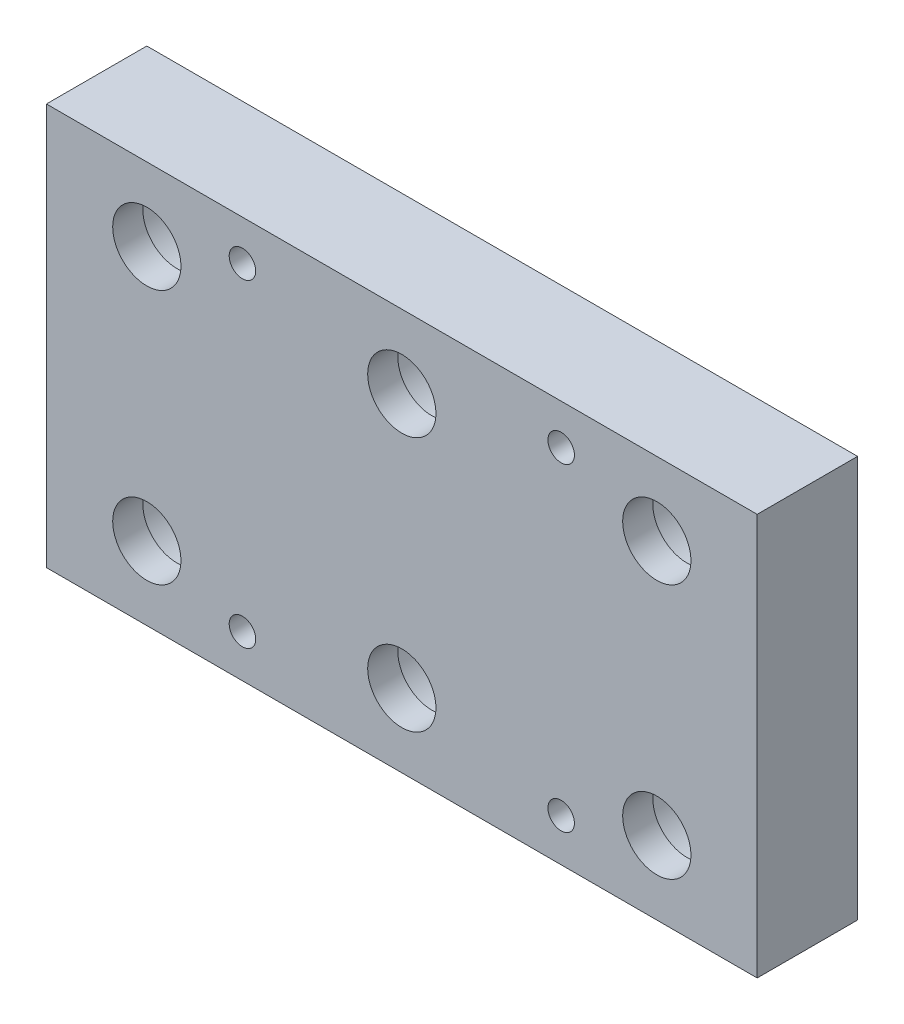
ISO-10303-21;
HEADER;
FILE_DESCRIPTION(('STEP AP214'),'2;1');
FILE_NAME('part.step','',(''),(''),'','','');
FILE_SCHEMA(('AUTOMOTIVE_DESIGN { 1 0 10303 214 1 1 1 1 }'));
ENDSEC;
DATA;
#1=APPLICATION_CONTEXT('core data for automotive mechanical design processes');
#2=APPLICATION_PROTOCOL_DEFINITION('international standard','automotive_design',2000,#1);
#3=PRODUCT_CONTEXT('',#1,'mechanical');
#4=PRODUCT('Part','Part','',(#3));
#5=PRODUCT_RELATED_PRODUCT_CATEGORY('part','',(#4));
#6=PRODUCT_DEFINITION_FORMATION('','',#4);
#7=PRODUCT_DEFINITION_CONTEXT('part definition',#1,'design');
#8=PRODUCT_DEFINITION('design','',#6,#7);
#9=PRODUCT_DEFINITION_SHAPE('','',#8);
#10=(LENGTH_UNIT() NAMED_UNIT(*) SI_UNIT(.MILLI.,.METRE.));
#11=(NAMED_UNIT(*) PLANE_ANGLE_UNIT() SI_UNIT($,.RADIAN.));
#12=(NAMED_UNIT(*) SI_UNIT($,.STERADIAN.) SOLID_ANGLE_UNIT());
#13=UNCERTAINTY_MEASURE_WITH_UNIT(LENGTH_MEASURE(1.E-05),#10,'distance_accuracy_value','');
#14=(GEOMETRIC_REPRESENTATION_CONTEXT(3) GLOBAL_UNCERTAINTY_ASSIGNED_CONTEXT((#13)) GLOBAL_UNIT_ASSIGNED_CONTEXT((#10,
#11,#12)) REPRESENTATION_CONTEXT('',''));
#15=CARTESIAN_POINT('',(0.,0.,0.));
#16=DIRECTION('',(0.,0.,1.));
#17=DIRECTION('',(1.,0.,0.));
#18=AXIS2_PLACEMENT_3D('',#15,#16,#17);
#19=CARTESIAN_POINT('',(-25.4,12.7,10.));
#20=DIRECTION('',(0.,0.,-1.));
#21=DIRECTION('',(-1.,0.,0.));
#22=AXIS2_PLACEMENT_3D('',#19,#20,#21);
#23=CYLINDRICAL_SURFACE('',#22,3.4);
#24=CARTESIAN_POINT('',(-25.4,12.7,10.));
#25=DIRECTION('',(0.,0.,-1.));
#26=DIRECTION('',(-1.,0.,0.));
#27=AXIS2_PLACEMENT_3D('',#24,#25,#26);
#28=CIRCLE('',#27,3.4);
#29=CARTESIAN_POINT('',(-28.8,12.7,10.));
#30=VERTEX_POINT('',#29);
#31=EDGE_CURVE('E164',#30,#30,#28,.T.);
#32=ORIENTED_EDGE('',*,*,#31,.F.);
#33=EDGE_LOOP('',(#32));
#34=FACE_BOUND('',#33,.T.);
#35=CARTESIAN_POINT('',(-25.4,12.7,7.));
#36=DIRECTION('',(0.,0.,-1.));
#37=DIRECTION('',(-1.,0.,0.));
#38=AXIS2_PLACEMENT_3D('',#35,#36,#37);
#39=CIRCLE('',#38,3.4);
#40=CARTESIAN_POINT('',(-28.8,12.7,7.));
#41=VERTEX_POINT('',#40);
#42=EDGE_CURVE('E38',#41,#41,#39,.F.);
#43=ORIENTED_EDGE('',*,*,#42,.F.);
#44=EDGE_LOOP('',(#43));
#45=FACE_BOUND('',#44,.T.);
#46=ADVANCED_FACE('F34',(#34,#45),#23,.F.);
#47=CARTESIAN_POINT('',(25.4,12.7,10.));
#48=DIRECTION('',(0.,0.,-1.));
#49=DIRECTION('',(-1.,0.,0.));
#50=AXIS2_PLACEMENT_3D('',#47,#48,#49);
#51=CYLINDRICAL_SURFACE('',#50,3.4);
#52=CARTESIAN_POINT('',(25.4,12.7,10.));
#53=DIRECTION('',(0.,0.,-1.));
#54=DIRECTION('',(-1.,0.,0.));
#55=AXIS2_PLACEMENT_3D('',#52,#53,#54);
#56=CIRCLE('',#55,3.4);
#57=CARTESIAN_POINT('',(22.,12.7,10.));
#58=VERTEX_POINT('',#57);
#59=EDGE_CURVE('E113',#58,#58,#56,.T.);
#60=ORIENTED_EDGE('',*,*,#59,.F.);
#61=EDGE_LOOP('',(#60));
#62=FACE_BOUND('',#61,.T.);
#63=CARTESIAN_POINT('',(25.4,12.7,7.));
#64=DIRECTION('',(0.,0.,-1.));
#65=DIRECTION('',(-1.,0.,0.));
#66=AXIS2_PLACEMENT_3D('',#63,#64,#65);
#67=CIRCLE('',#66,3.4);
#68=CARTESIAN_POINT('',(22.,12.7,7.));
#69=VERTEX_POINT('',#68);
#70=EDGE_CURVE('E129',#69,#69,#67,.F.);
#71=ORIENTED_EDGE('',*,*,#70,.F.);
#72=EDGE_LOOP('',(#71));
#73=FACE_BOUND('',#72,.T.);
#74=ADVANCED_FACE('F220',(#62,#73),#51,.F.);
#75=CARTESIAN_POINT('',(0.,12.7,10.));
#76=DIRECTION('',(0.,0.,-1.));
#77=DIRECTION('',(-1.,0.,0.));
#78=AXIS2_PLACEMENT_3D('',#75,#76,#77);
#79=CYLINDRICAL_SURFACE('',#78,3.4);
#80=CARTESIAN_POINT('',(0.,12.7,10.));
#81=DIRECTION('',(0.,0.,-1.));
#82=DIRECTION('',(-1.,0.,0.));
#83=AXIS2_PLACEMENT_3D('',#80,#81,#82);
#84=CIRCLE('',#83,3.4);
#85=CARTESIAN_POINT('',(-3.4,12.7,10.));
#86=VERTEX_POINT('',#85);
#87=EDGE_CURVE('E167',#86,#86,#84,.T.);
#88=ORIENTED_EDGE('',*,*,#87,.F.);
#89=EDGE_LOOP('',(#88));
#90=FACE_BOUND('',#89,.T.);
#91=CARTESIAN_POINT('',(0.,12.7,7.));
#92=DIRECTION('',(0.,0.,-1.));
#93=DIRECTION('',(-1.,0.,0.));
#94=AXIS2_PLACEMENT_3D('',#91,#92,#93);
#95=CIRCLE('',#94,3.4);
#96=CARTESIAN_POINT('',(-3.4,12.7,7.));
#97=VERTEX_POINT('',#96);
#98=EDGE_CURVE('E125',#97,#97,#95,.F.);
#99=ORIENTED_EDGE('',*,*,#98,.F.);
#100=EDGE_LOOP('',(#99));
#101=FACE_BOUND('',#100,.T.);
#102=ADVANCED_FACE('F226',(#90,#101),#79,.F.);
#103=CARTESIAN_POINT('',(25.4,-12.7,10.));
#104=DIRECTION('',(0.,0.,-1.));
#105=DIRECTION('',(-1.,0.,0.));
#106=AXIS2_PLACEMENT_3D('',#103,#104,#105);
#107=CYLINDRICAL_SURFACE('',#106,3.4);
#108=CARTESIAN_POINT('',(25.4,-12.7,10.));
#109=DIRECTION('',(0.,0.,-1.));
#110=DIRECTION('',(-1.,0.,0.));
#111=AXIS2_PLACEMENT_3D('',#108,#109,#110);
#112=CIRCLE('',#111,3.4);
#113=CARTESIAN_POINT('',(22.,-12.7,10.));
#114=VERTEX_POINT('',#113);
#115=EDGE_CURVE('E176',#114,#114,#112,.T.);
#116=ORIENTED_EDGE('',*,*,#115,.F.);
#117=EDGE_LOOP('',(#116));
#118=FACE_BOUND('',#117,.T.);
#119=CARTESIAN_POINT('',(25.4,-12.7,7.));
#120=DIRECTION('',(0.,0.,-1.));
#121=DIRECTION('',(-1.,0.,0.));
#122=AXIS2_PLACEMENT_3D('',#119,#120,#121);
#123=CIRCLE('',#122,3.4);
#124=CARTESIAN_POINT('',(22.,-12.7,7.));
#125=VERTEX_POINT('',#124);
#126=EDGE_CURVE('E120',#125,#125,#123,.F.);
#127=ORIENTED_EDGE('',*,*,#126,.F.);
#128=EDGE_LOOP('',(#127));
#129=FACE_BOUND('',#128,.T.);
#130=ADVANCED_FACE('F235',(#118,#129),#107,.F.);
#131=CARTESIAN_POINT('',(0.,-12.7,10.));
#132=DIRECTION('',(0.,0.,-1.));
#133=DIRECTION('',(-1.,0.,0.));
#134=AXIS2_PLACEMENT_3D('',#131,#132,#133);
#135=CYLINDRICAL_SURFACE('',#134,3.4);
#136=CARTESIAN_POINT('',(0.,-12.7,10.));
#137=DIRECTION('',(0.,0.,-1.));
#138=DIRECTION('',(-1.,0.,0.));
#139=AXIS2_PLACEMENT_3D('',#136,#137,#138);
#140=CIRCLE('',#139,3.4);
#141=CARTESIAN_POINT('',(-3.40000000000001,-12.7,10.));
#142=VERTEX_POINT('',#141);
#143=EDGE_CURVE('E173',#142,#142,#140,.T.);
#144=ORIENTED_EDGE('',*,*,#143,.F.);
#145=EDGE_LOOP('',(#144));
#146=FACE_BOUND('',#145,.T.);
#147=CARTESIAN_POINT('',(0.,-12.7,7.));
#148=DIRECTION('',(0.,0.,-1.));
#149=DIRECTION('',(-1.,0.,0.));
#150=AXIS2_PLACEMENT_3D('',#147,#148,#149);
#151=CIRCLE('',#150,3.4);
#152=CARTESIAN_POINT('',(-3.40000000000001,-12.7,7.));
#153=VERTEX_POINT('',#152);
#154=EDGE_CURVE('E115',#153,#153,#151,.F.);
#155=ORIENTED_EDGE('',*,*,#154,.F.);
#156=EDGE_LOOP('',(#155));
#157=FACE_BOUND('',#156,.T.);
#158=ADVANCED_FACE('F240',(#146,#157),#135,.F.);
#159=CARTESIAN_POINT('',(-25.4,-12.7,10.));
#160=DIRECTION('',(0.,0.,-1.));
#161=DIRECTION('',(-1.,0.,0.));
#162=AXIS2_PLACEMENT_3D('',#159,#160,#161);
#163=CYLINDRICAL_SURFACE('',#162,3.4);
#164=CARTESIAN_POINT('',(-25.4,-12.7,10.));
#165=DIRECTION('',(0.,0.,-1.));
#166=DIRECTION('',(-1.,0.,0.));
#167=AXIS2_PLACEMENT_3D('',#164,#165,#166);
#168=CIRCLE('',#167,3.4);
#169=CARTESIAN_POINT('',(-28.8,-12.7,10.));
#170=VERTEX_POINT('',#169);
#171=EDGE_CURVE('E170',#170,#170,#168,.T.);
#172=ORIENTED_EDGE('',*,*,#171,.F.);
#173=EDGE_LOOP('',(#172));
#174=FACE_BOUND('',#173,.T.);
#175=CARTESIAN_POINT('',(-25.4,-12.7,7.));
#176=DIRECTION('',(0.,0.,-1.));
#177=DIRECTION('',(-1.,0.,0.));
#178=AXIS2_PLACEMENT_3D('',#175,#176,#177);
#179=CIRCLE('',#178,3.4);
#180=CARTESIAN_POINT('',(-28.8,-12.7,7.));
#181=VERTEX_POINT('',#180);
#182=EDGE_CURVE('E110',#181,#181,#179,.F.);
#183=ORIENTED_EDGE('',*,*,#182,.F.);
#184=EDGE_LOOP('',(#183));
#185=FACE_BOUND('',#184,.T.);
#186=ADVANCED_FACE('F237',(#174,#185),#163,.F.);
#187=CARTESIAN_POINT('',(35.4,20.,10.));
#188=DIRECTION('',(-1.,0.,0.));
#189=DIRECTION('',(0.,-1.,0.));
#190=AXIS2_PLACEMENT_3D('',#187,#188,#189);
#191=PLANE('',#190);
#192=DIRECTION('',(0.,1.,0.));
#193=VECTOR('',#192,1.);
#194=CARTESIAN_POINT('',(35.4,20.,0.));
#195=LINE('',#194,#193);
#196=CARTESIAN_POINT('',(35.4,-20.,0.));
#197=VERTEX_POINT('',#196);
#198=CARTESIAN_POINT('',(35.4,20.,0.));
#199=VERTEX_POINT('',#198);
#200=EDGE_CURVE('E101',#197,#199,#195,.T.);
#201=ORIENTED_EDGE('',*,*,#200,.T.);
#202=DIRECTION('',(0.,0.,-1.));
#203=VECTOR('',#202,1.);
#204=CARTESIAN_POINT('',(35.4,20.,10.));
#205=LINE('',#204,#203);
#206=CARTESIAN_POINT('',(35.4,20.,10.));
#207=VERTEX_POINT('',#206);
#208=EDGE_CURVE('E11',#207,#199,#205,.T.);
#209=ORIENTED_EDGE('',*,*,#208,.F.);
#210=DIRECTION('',(0.,1.,0.));
#211=VECTOR('',#210,1.);
#212=CARTESIAN_POINT('',(35.4,20.,10.));
#213=LINE('',#212,#211);
#214=CARTESIAN_POINT('',(35.4,-20.,10.));
#215=VERTEX_POINT('',#214);
#216=EDGE_CURVE('E88',#215,#207,#213,.T.);
#217=ORIENTED_EDGE('',*,*,#216,.F.);
#218=DIRECTION('',(0.,0.,-1.));
#219=VECTOR('',#218,1.);
#220=CARTESIAN_POINT('',(35.4,-20.,10.));
#221=LINE('',#220,#219);
#222=EDGE_CURVE('E97',#215,#197,#221,.T.);
#223=ORIENTED_EDGE('',*,*,#222,.T.);
#224=EDGE_LOOP('',(#201,#209,#217,#223));
#225=FACE_BOUND('',#224,.T.);
#226=ADVANCED_FACE('F36',(#225),#191,.F.);
#227=CARTESIAN_POINT('',(35.4,20.,10.));
#228=DIRECTION('',(0.,-1.,0.));
#229=DIRECTION('',(1.,0.,0.));
#230=AXIS2_PLACEMENT_3D('',#227,#228,#229);
#231=PLANE('',#230);
#232=DIRECTION('',(-1.,0.,0.));
#233=VECTOR('',#232,1.);
#234=CARTESIAN_POINT('',(35.4,20.,0.));
#235=LINE('',#234,#233);
#236=CARTESIAN_POINT('',(-35.4,20.,0.));
#237=VERTEX_POINT('',#236);
#238=EDGE_CURVE('E92',#199,#237,#235,.T.);
#239=ORIENTED_EDGE('',*,*,#238,.T.);
#240=DIRECTION('',(0.,0.,-1.));
#241=VECTOR('',#240,1.);
#242=CARTESIAN_POINT('',(-35.4,20.,10.));
#243=LINE('',#242,#241);
#244=CARTESIAN_POINT('',(-35.4,20.,10.));
#245=VERTEX_POINT('',#244);
#246=EDGE_CURVE('E44',#245,#237,#243,.T.);
#247=ORIENTED_EDGE('',*,*,#246,.F.);
#248=DIRECTION('',(-1.,0.,0.));
#249=VECTOR('',#248,1.);
#250=CARTESIAN_POINT('',(35.4,20.,10.));
#251=LINE('',#250,#249);
#252=EDGE_CURVE('E83',#207,#245,#251,.T.);
#253=ORIENTED_EDGE('',*,*,#252,.F.);
#254=ORIENTED_EDGE('',*,*,#208,.T.);
#255=EDGE_LOOP('',(#239,#247,#253,#254));
#256=FACE_BOUND('',#255,.T.);
#257=ADVANCED_FACE('F91',(#256),#231,.F.);
#258=CARTESIAN_POINT('',(-35.4,20.,10.));
#259=DIRECTION('',(1.,0.,0.));
#260=DIRECTION('',(0.,1.,0.));
#261=AXIS2_PLACEMENT_3D('',#258,#259,#260);
#262=PLANE('',#261);
#263=DIRECTION('',(0.,-1.,0.));
#264=VECTOR('',#263,1.);
#265=CARTESIAN_POINT('',(-35.4,20.,0.));
#266=LINE('',#265,#264);
#267=CARTESIAN_POINT('',(-35.4,-20.,0.));
#268=VERTEX_POINT('',#267);
#269=EDGE_CURVE('E70',#237,#268,#266,.T.);
#270=ORIENTED_EDGE('',*,*,#269,.T.);
#271=DIRECTION('',(0.,0.,-1.));
#272=VECTOR('',#271,1.);
#273=CARTESIAN_POINT('',(-35.4,-20.,10.));
#274=LINE('',#273,#272);
#275=CARTESIAN_POINT('',(-35.4,-20.,10.));
#276=VERTEX_POINT('',#275);
#277=EDGE_CURVE('E93',#276,#268,#274,.T.);
#278=ORIENTED_EDGE('',*,*,#277,.F.);
#279=DIRECTION('',(0.,-1.,0.));
#280=VECTOR('',#279,1.);
#281=CARTESIAN_POINT('',(-35.4,20.,10.));
#282=LINE('',#281,#280);
#283=EDGE_CURVE('E86',#245,#276,#282,.T.);
#284=ORIENTED_EDGE('',*,*,#283,.F.);
#285=ORIENTED_EDGE('',*,*,#246,.T.);
#286=EDGE_LOOP('',(#270,#278,#284,#285));
#287=FACE_BOUND('',#286,.T.);
#288=ADVANCED_FACE('F95',(#287),#262,.F.);
#289=CARTESIAN_POINT('',(35.4,-20.,10.));
#290=DIRECTION('',(0.,1.,0.));
#291=DIRECTION('',(-1.,0.,0.));
#292=AXIS2_PLACEMENT_3D('',#289,#290,#291);
#293=PLANE('',#292);
#294=DIRECTION('',(1.,0.,0.));
#295=VECTOR('',#294,1.);
#296=CARTESIAN_POINT('',(35.4,-20.,0.));
#297=LINE('',#296,#295);
#298=EDGE_CURVE('E76',#268,#197,#297,.T.);
#299=ORIENTED_EDGE('',*,*,#298,.T.);
#300=ORIENTED_EDGE('',*,*,#222,.F.);
#301=DIRECTION('',(1.,0.,0.));
#302=VECTOR('',#301,1.);
#303=CARTESIAN_POINT('',(35.4,-20.,10.));
#304=LINE('',#303,#302);
#305=EDGE_CURVE('E53',#276,#215,#304,.T.);
#306=ORIENTED_EDGE('',*,*,#305,.F.);
#307=ORIENTED_EDGE('',*,*,#277,.T.);
#308=EDGE_LOOP('',(#299,#300,#306,#307));
#309=FACE_BOUND('',#308,.T.);
#310=ADVANCED_FACE('F207',(#309),#293,.F.);
#311=CARTESIAN_POINT('',(0.,0.,10.));
#312=DIRECTION('',(0.,0.,-1.));
#313=DIRECTION('',(-1.,0.,0.));
#314=AXIS2_PLACEMENT_3D('',#311,#312,#313);
#315=PLANE('',#314);
#316=ORIENTED_EDGE('',*,*,#59,.T.);
#317=EDGE_LOOP('',(#316));
#318=FACE_BOUND('',#317,.T.);
#319=ORIENTED_EDGE('',*,*,#31,.T.);
#320=EDGE_LOOP('',(#319));
#321=FACE_BOUND('',#320,.T.);
#322=ORIENTED_EDGE('',*,*,#87,.T.);
#323=EDGE_LOOP('',(#322));
#324=FACE_BOUND('',#323,.T.);
#325=ORIENTED_EDGE('',*,*,#171,.T.);
#326=EDGE_LOOP('',(#325));
#327=FACE_BOUND('',#326,.T.);
#328=ORIENTED_EDGE('',*,*,#143,.T.);
#329=EDGE_LOOP('',(#328));
#330=FACE_BOUND('',#329,.T.);
#331=ORIENTED_EDGE('',*,*,#115,.T.);
#332=EDGE_LOOP('',(#331));
#333=FACE_BOUND('',#332,.T.);
#334=CARTESIAN_POINT('',(15.875,16.,10.));
#335=DIRECTION('',(0.,0.,1.));
#336=DIRECTION('',(1.,0.,0.));
#337=AXIS2_PLACEMENT_3D('',#334,#335,#336);
#338=CIRCLE('',#337,1.32);
#339=CARTESIAN_POINT('',(17.195,16.,10.));
#340=VERTEX_POINT('',#339);
#341=EDGE_CURVE('E179',#340,#340,#338,.T.);
#342=ORIENTED_EDGE('',*,*,#341,.F.);
#343=EDGE_LOOP('',(#342));
#344=FACE_BOUND('',#343,.T.);
#345=CARTESIAN_POINT('',(-15.875,16.,10.));
#346=DIRECTION('',(0.,0.,1.));
#347=DIRECTION('',(1.,0.,0.));
#348=AXIS2_PLACEMENT_3D('',#345,#346,#347);
#349=CIRCLE('',#348,1.32);
#350=CARTESIAN_POINT('',(-14.555,16.,10.));
#351=VERTEX_POINT('',#350);
#352=EDGE_CURVE('E183',#351,#351,#349,.T.);
#353=ORIENTED_EDGE('',*,*,#352,.F.);
#354=EDGE_LOOP('',(#353));
#355=FACE_BOUND('',#354,.T.);
#356=CARTESIAN_POINT('',(-15.875,-15.7499999999998,10.));
#357=DIRECTION('',(0.,0.,1.));
#358=DIRECTION('',(1.,0.,0.));
#359=AXIS2_PLACEMENT_3D('',#356,#357,#358);
#360=CIRCLE('',#359,1.31999999999994);
#361=CARTESIAN_POINT('',(-14.5550000000001,-15.7499999999998,10.));
#362=VERTEX_POINT('',#361);
#363=EDGE_CURVE('E189',#362,#362,#360,.T.);
#364=ORIENTED_EDGE('',*,*,#363,.F.);
#365=EDGE_LOOP('',(#364));
#366=FACE_BOUND('',#365,.T.);
#367=CARTESIAN_POINT('',(15.875,-15.7499999999998,10.));
#368=DIRECTION('',(0.,0.,1.));
#369=DIRECTION('',(1.,0.,0.));
#370=AXIS2_PLACEMENT_3D('',#367,#368,#369);
#371=CIRCLE('',#370,1.32);
#372=CARTESIAN_POINT('',(17.195,-15.7499999999998,10.));
#373=VERTEX_POINT('',#372);
#374=EDGE_CURVE('E195',#373,#373,#371,.T.);
#375=ORIENTED_EDGE('',*,*,#374,.F.);
#376=EDGE_LOOP('',(#375));
#377=FACE_BOUND('',#376,.T.);
#378=ORIENTED_EDGE('',*,*,#216,.T.);
#379=ORIENTED_EDGE('',*,*,#252,.T.);
#380=ORIENTED_EDGE('',*,*,#283,.T.);
#381=ORIENTED_EDGE('',*,*,#305,.T.);
#382=EDGE_LOOP('',(#378,#379,#380,#381));
#383=FACE_BOUND('',#382,.T.);
#384=ADVANCED_FACE('F84',(#318,#321,#324,#327,#330,#333,#344,#355,#366,#377,#383),#315,.F.);
#385=CARTESIAN_POINT('',(0.,0.,0.));
#386=DIRECTION('',(0.,0.,-1.));
#387=DIRECTION('',(-1.,0.,0.));
#388=AXIS2_PLACEMENT_3D('',#385,#386,#387);
#389=PLANE('',#388);
#390=CARTESIAN_POINT('',(-25.4,12.7,0.));
#391=DIRECTION('',(0.,0.,-1.));
#392=DIRECTION('',(-1.,0.,0.));
#393=AXIS2_PLACEMENT_3D('',#390,#391,#392);
#394=CIRCLE('',#393,5.375);
#395=CARTESIAN_POINT('',(-30.775,12.7,0.));
#396=VERTEX_POINT('',#395);
#397=EDGE_CURVE('E145',#396,#396,#394,.T.);
#398=ORIENTED_EDGE('',*,*,#397,.F.);
#399=EDGE_LOOP('',(#398));
#400=FACE_BOUND('',#399,.T.);
#401=CARTESIAN_POINT('',(25.4,12.7,0.));
#402=DIRECTION('',(0.,0.,-1.));
#403=DIRECTION('',(-1.,0.,0.));
#404=AXIS2_PLACEMENT_3D('',#401,#402,#403);
#405=CIRCLE('',#404,5.375);
#406=CARTESIAN_POINT('',(20.025,12.7,0.));
#407=VERTEX_POINT('',#406);
#408=EDGE_CURVE('E138',#407,#407,#405,.T.);
#409=ORIENTED_EDGE('',*,*,#408,.F.);
#410=EDGE_LOOP('',(#409));
#411=FACE_BOUND('',#410,.T.);
#412=CARTESIAN_POINT('',(0.,12.7,0.));
#413=DIRECTION('',(0.,0.,-1.));
#414=DIRECTION('',(-1.,0.,0.));
#415=AXIS2_PLACEMENT_3D('',#412,#413,#414);
#416=CIRCLE('',#415,5.375);
#417=CARTESIAN_POINT('',(-5.375,12.7,0.));
#418=VERTEX_POINT('',#417);
#419=EDGE_CURVE('E131',#418,#418,#416,.T.);
#420=ORIENTED_EDGE('',*,*,#419,.F.);
#421=EDGE_LOOP('',(#420));
#422=FACE_BOUND('',#421,.T.);
#423=CARTESIAN_POINT('',(25.4,-12.7,0.));
#424=DIRECTION('',(0.,0.,-1.));
#425=DIRECTION('',(-1.,0.,0.));
#426=AXIS2_PLACEMENT_3D('',#423,#424,#425);
#427=CIRCLE('',#426,5.375);
#428=CARTESIAN_POINT('',(20.025,-12.7,0.));
#429=VERTEX_POINT('',#428);
#430=EDGE_CURVE('E127',#429,#429,#427,.T.);
#431=ORIENTED_EDGE('',*,*,#430,.F.);
#432=EDGE_LOOP('',(#431));
#433=FACE_BOUND('',#432,.T.);
#434=CARTESIAN_POINT('',(0.,-12.7,0.));
#435=DIRECTION('',(0.,0.,-1.));
#436=DIRECTION('',(-1.,0.,0.));
#437=AXIS2_PLACEMENT_3D('',#434,#435,#436);
#438=CIRCLE('',#437,5.375);
#439=CARTESIAN_POINT('',(-5.375,-12.7,0.));
#440=VERTEX_POINT('',#439);
#441=EDGE_CURVE('E123',#440,#440,#438,.T.);
#442=ORIENTED_EDGE('',*,*,#441,.F.);
#443=EDGE_LOOP('',(#442));
#444=FACE_BOUND('',#443,.T.);
#445=CARTESIAN_POINT('',(-25.4,-12.7,0.));
#446=DIRECTION('',(0.,0.,-1.));
#447=DIRECTION('',(-1.,0.,0.));
#448=AXIS2_PLACEMENT_3D('',#445,#446,#447);
#449=CIRCLE('',#448,5.375);
#450=CARTESIAN_POINT('',(-30.775,-12.7,0.));
#451=VERTEX_POINT('',#450);
#452=EDGE_CURVE('E118',#451,#451,#449,.T.);
#453=ORIENTED_EDGE('',*,*,#452,.F.);
#454=EDGE_LOOP('',(#453));
#455=FACE_BOUND('',#454,.T.);
#456=CARTESIAN_POINT('',(15.875,16.,0.));
#457=DIRECTION('',(0.,0.,1.));
#458=DIRECTION('',(1.,0.,0.));
#459=AXIS2_PLACEMENT_3D('',#456,#457,#458);
#460=CIRCLE('',#459,1.32);
#461=CARTESIAN_POINT('',(17.195,16.,0.));
#462=VERTEX_POINT('',#461);
#463=EDGE_CURVE('E180',#462,#462,#460,.T.);
#464=ORIENTED_EDGE('',*,*,#463,.T.);
#465=EDGE_LOOP('',(#464));
#466=FACE_BOUND('',#465,.T.);
#467=CARTESIAN_POINT('',(-15.875,16.,0.));
#468=DIRECTION('',(0.,0.,1.));
#469=DIRECTION('',(1.,0.,0.));
#470=AXIS2_PLACEMENT_3D('',#467,#468,#469);
#471=CIRCLE('',#470,1.32);
#472=CARTESIAN_POINT('',(-14.555,16.,0.));
#473=VERTEX_POINT('',#472);
#474=EDGE_CURVE('E186',#473,#473,#471,.T.);
#475=ORIENTED_EDGE('',*,*,#474,.T.);
#476=EDGE_LOOP('',(#475));
#477=FACE_BOUND('',#476,.T.);
#478=CARTESIAN_POINT('',(-15.875,-15.7499999999998,0.));
#479=DIRECTION('',(0.,0.,1.));
#480=DIRECTION('',(1.,0.,0.));
#481=AXIS2_PLACEMENT_3D('',#478,#479,#480);
#482=CIRCLE('',#481,1.31999999999994);
#483=CARTESIAN_POINT('',(-14.5550000000001,-15.7499999999998,0.));
#484=VERTEX_POINT('',#483);
#485=EDGE_CURVE('E192',#484,#484,#482,.T.);
#486=ORIENTED_EDGE('',*,*,#485,.T.);
#487=EDGE_LOOP('',(#486));
#488=FACE_BOUND('',#487,.T.);
#489=CARTESIAN_POINT('',(15.875,-15.7499999999998,0.));
#490=DIRECTION('',(0.,0.,1.));
#491=DIRECTION('',(1.,0.,0.));
#492=AXIS2_PLACEMENT_3D('',#489,#490,#491);
#493=CIRCLE('',#492,1.32);
#494=CARTESIAN_POINT('',(17.195,-15.7499999999998,0.));
#495=VERTEX_POINT('',#494);
#496=EDGE_CURVE('E104',#495,#495,#493,.T.);
#497=ORIENTED_EDGE('',*,*,#496,.T.);
#498=EDGE_LOOP('',(#497));
#499=FACE_BOUND('',#498,.T.);
#500=ORIENTED_EDGE('',*,*,#200,.F.);
#501=ORIENTED_EDGE('',*,*,#298,.F.);
#502=ORIENTED_EDGE('',*,*,#269,.F.);
#503=ORIENTED_EDGE('',*,*,#238,.F.);
#504=EDGE_LOOP('',(#500,#501,#502,#503));
#505=FACE_BOUND('',#504,.T.);
#506=ADVANCED_FACE('F206',(#400,#411,#422,#433,#444,#455,#466,#477,#488,#499,#505),#389,.T.);
#507=CARTESIAN_POINT('',(15.875,-15.7499999999998,0.));
#508=DIRECTION('',(0.,0.,1.));
#509=DIRECTION('',(1.,0.,0.));
#510=AXIS2_PLACEMENT_3D('',#507,#508,#509);
#511=CYLINDRICAL_SURFACE('',#510,1.32);
#512=ORIENTED_EDGE('',*,*,#496,.F.);
#513=EDGE_LOOP('',(#512));
#514=FACE_BOUND('',#513,.T.);
#515=ORIENTED_EDGE('',*,*,#374,.T.);
#516=EDGE_LOOP('',(#515));
#517=FACE_BOUND('',#516,.T.);
#518=ADVANCED_FACE('F203',(#514,#517),#511,.F.);
#519=CARTESIAN_POINT('',(-15.875,-15.7499999999998,0.));
#520=DIRECTION('',(0.,0.,1.));
#521=DIRECTION('',(1.,0.,0.));
#522=AXIS2_PLACEMENT_3D('',#519,#520,#521);
#523=CYLINDRICAL_SURFACE('',#522,1.31999999999994);
#524=ORIENTED_EDGE('',*,*,#485,.F.);
#525=EDGE_LOOP('',(#524));
#526=FACE_BOUND('',#525,.T.);
#527=ORIENTED_EDGE('',*,*,#363,.T.);
#528=EDGE_LOOP('',(#527));
#529=FACE_BOUND('',#528,.T.);
#530=ADVANCED_FACE('F256',(#526,#529),#523,.F.);
#531=CARTESIAN_POINT('',(-15.875,16.,0.));
#532=DIRECTION('',(0.,0.,1.));
#533=DIRECTION('',(1.,0.,0.));
#534=AXIS2_PLACEMENT_3D('',#531,#532,#533);
#535=CYLINDRICAL_SURFACE('',#534,1.32);
#536=ORIENTED_EDGE('',*,*,#474,.F.);
#537=EDGE_LOOP('',(#536));
#538=FACE_BOUND('',#537,.T.);
#539=ORIENTED_EDGE('',*,*,#352,.T.);
#540=EDGE_LOOP('',(#539));
#541=FACE_BOUND('',#540,.T.);
#542=ADVANCED_FACE('F252',(#538,#541),#535,.F.);
#543=CARTESIAN_POINT('',(15.875,16.,0.));
#544=DIRECTION('',(0.,0.,1.));
#545=DIRECTION('',(1.,0.,0.));
#546=AXIS2_PLACEMENT_3D('',#543,#544,#545);
#547=CYLINDRICAL_SURFACE('',#546,1.32);
#548=ORIENTED_EDGE('',*,*,#463,.F.);
#549=EDGE_LOOP('',(#548));
#550=FACE_BOUND('',#549,.T.);
#551=ORIENTED_EDGE('',*,*,#341,.T.);
#552=EDGE_LOOP('',(#551));
#553=FACE_BOUND('',#552,.T.);
#554=ADVANCED_FACE('F248',(#550,#553),#547,.F.);
#555=CARTESIAN_POINT('',(-25.4,-12.7,7.));
#556=DIRECTION('',(0.,0.,-1.));
#557=DIRECTION('',(-1.,0.,0.));
#558=AXIS2_PLACEMENT_3D('',#555,#556,#557);
#559=PLANE('',#558);
#560=CARTESIAN_POINT('',(-25.4,-12.7,7.));
#561=DIRECTION('',(0.,0.,-1.));
#562=DIRECTION('',(-1.,0.,0.));
#563=AXIS2_PLACEMENT_3D('',#560,#561,#562);
#564=CIRCLE('',#563,5.375);
#565=CARTESIAN_POINT('',(-30.775,-12.7,7.));
#566=VERTEX_POINT('',#565);
#567=EDGE_CURVE('E114',#566,#566,#564,.T.);
#568=ORIENTED_EDGE('',*,*,#567,.T.);
#569=EDGE_LOOP('',(#568));
#570=FACE_BOUND('',#569,.T.);
#571=ORIENTED_EDGE('',*,*,#182,.T.);
#572=EDGE_LOOP('',(#571));
#573=FACE_BOUND('',#572,.T.);
#574=ADVANCED_FACE('F251',(#570,#573),#559,.T.);
#575=CARTESIAN_POINT('',(-25.4,-12.7,7.));
#576=DIRECTION('',(0.,0.,-1.));
#577=DIRECTION('',(-1.,0.,0.));
#578=AXIS2_PLACEMENT_3D('',#575,#576,#577);
#579=CYLINDRICAL_SURFACE('',#578,5.375);
#580=ORIENTED_EDGE('',*,*,#567,.F.);
#581=EDGE_LOOP('',(#580));
#582=FACE_BOUND('',#581,.T.);
#583=ORIENTED_EDGE('',*,*,#452,.T.);
#584=EDGE_LOOP('',(#583));
#585=FACE_BOUND('',#584,.T.);
#586=ADVANCED_FACE('F360',(#582,#585),#579,.F.);
#587=CARTESIAN_POINT('',(0.,-12.7,7.));
#588=DIRECTION('',(0.,0.,-1.));
#589=DIRECTION('',(-1.,0.,0.));
#590=AXIS2_PLACEMENT_3D('',#587,#588,#589);
#591=PLANE('',#590);
#592=CARTESIAN_POINT('',(0.,-12.7,7.));
#593=DIRECTION('',(0.,0.,-1.));
#594=DIRECTION('',(-1.,0.,0.));
#595=AXIS2_PLACEMENT_3D('',#592,#593,#594);
#596=CIRCLE('',#595,5.375);
#597=CARTESIAN_POINT('',(-5.375,-12.7,7.));
#598=VERTEX_POINT('',#597);
#599=EDGE_CURVE('E119',#598,#598,#596,.T.);
#600=ORIENTED_EDGE('',*,*,#599,.T.);
#601=EDGE_LOOP('',(#600));
#602=FACE_BOUND('',#601,.T.);
#603=ORIENTED_EDGE('',*,*,#154,.T.);
#604=EDGE_LOOP('',(#603));
#605=FACE_BOUND('',#604,.T.);
#606=ADVANCED_FACE('F370',(#602,#605),#591,.T.);
#607=CARTESIAN_POINT('',(0.,-12.7,7.));
#608=DIRECTION('',(0.,0.,-1.));
#609=DIRECTION('',(-1.,0.,0.));
#610=AXIS2_PLACEMENT_3D('',#607,#608,#609);
#611=CYLINDRICAL_SURFACE('',#610,5.375);
#612=ORIENTED_EDGE('',*,*,#599,.F.);
#613=EDGE_LOOP('',(#612));
#614=FACE_BOUND('',#613,.T.);
#615=ORIENTED_EDGE('',*,*,#441,.T.);
#616=EDGE_LOOP('',(#615));
#617=FACE_BOUND('',#616,.T.);
#618=ADVANCED_FACE('F379',(#614,#617),#611,.F.);
#619=CARTESIAN_POINT('',(25.4,-12.7,7.));
#620=DIRECTION('',(0.,0.,-1.));
#621=DIRECTION('',(-1.,0.,0.));
#622=AXIS2_PLACEMENT_3D('',#619,#620,#621);
#623=PLANE('',#622);
#624=CARTESIAN_POINT('',(25.4,-12.7,7.));
#625=DIRECTION('',(0.,0.,-1.));
#626=DIRECTION('',(-1.,0.,0.));
#627=AXIS2_PLACEMENT_3D('',#624,#625,#626);
#628=CIRCLE('',#627,5.375);
#629=CARTESIAN_POINT('',(20.025,-12.7,7.));
#630=VERTEX_POINT('',#629);
#631=EDGE_CURVE('E124',#630,#630,#628,.T.);
#632=ORIENTED_EDGE('',*,*,#631,.T.);
#633=EDGE_LOOP('',(#632));
#634=FACE_BOUND('',#633,.T.);
#635=ORIENTED_EDGE('',*,*,#126,.T.);
#636=EDGE_LOOP('',(#635));
#637=FACE_BOUND('',#636,.T.);
#638=ADVANCED_FACE('F389',(#634,#637),#623,.T.);
#639=CARTESIAN_POINT('',(25.4,-12.7,7.));
#640=DIRECTION('',(0.,0.,-1.));
#641=DIRECTION('',(-1.,0.,0.));
#642=AXIS2_PLACEMENT_3D('',#639,#640,#641);
#643=CYLINDRICAL_SURFACE('',#642,5.375);
#644=ORIENTED_EDGE('',*,*,#631,.F.);
#645=EDGE_LOOP('',(#644));
#646=FACE_BOUND('',#645,.T.);
#647=ORIENTED_EDGE('',*,*,#430,.T.);
#648=EDGE_LOOP('',(#647));
#649=FACE_BOUND('',#648,.T.);
#650=ADVANCED_FACE('F399',(#646,#649),#643,.F.);
#651=CARTESIAN_POINT('',(0.,12.7,7.));
#652=DIRECTION('',(0.,0.,-1.));
#653=DIRECTION('',(-1.,0.,0.));
#654=AXIS2_PLACEMENT_3D('',#651,#652,#653);
#655=PLANE('',#654);
#656=CARTESIAN_POINT('',(0.,12.7,7.));
#657=DIRECTION('',(0.,0.,-1.));
#658=DIRECTION('',(-1.,0.,0.));
#659=AXIS2_PLACEMENT_3D('',#656,#657,#658);
#660=CIRCLE('',#659,5.375);
#661=CARTESIAN_POINT('',(-5.375,12.7,7.));
#662=VERTEX_POINT('',#661);
#663=EDGE_CURVE('E128',#662,#662,#660,.T.);
#664=ORIENTED_EDGE('',*,*,#663,.T.);
#665=EDGE_LOOP('',(#664));
#666=FACE_BOUND('',#665,.T.);
#667=ORIENTED_EDGE('',*,*,#98,.T.);
#668=EDGE_LOOP('',(#667));
#669=FACE_BOUND('',#668,.T.);
#670=ADVANCED_FACE('F409',(#666,#669),#655,.T.);
#671=CARTESIAN_POINT('',(0.,12.7,7.));
#672=DIRECTION('',(0.,0.,-1.));
#673=DIRECTION('',(-1.,0.,0.));
#674=AXIS2_PLACEMENT_3D('',#671,#672,#673);
#675=CYLINDRICAL_SURFACE('',#674,5.375);
#676=ORIENTED_EDGE('',*,*,#663,.F.);
#677=EDGE_LOOP('',(#676));
#678=FACE_BOUND('',#677,.T.);
#679=ORIENTED_EDGE('',*,*,#419,.T.);
#680=EDGE_LOOP('',(#679));
#681=FACE_BOUND('',#680,.T.);
#682=ADVANCED_FACE('F419',(#678,#681),#675,.F.);
#683=CARTESIAN_POINT('',(25.4,12.7,7.));
#684=DIRECTION('',(0.,0.,-1.));
#685=DIRECTION('',(-1.,0.,0.));
#686=AXIS2_PLACEMENT_3D('',#683,#684,#685);
#687=PLANE('',#686);
#688=CARTESIAN_POINT('',(25.4,12.7,7.));
#689=DIRECTION('',(0.,0.,-1.));
#690=DIRECTION('',(-1.,0.,0.));
#691=AXIS2_PLACEMENT_3D('',#688,#689,#690);
#692=CIRCLE('',#691,5.375);
#693=CARTESIAN_POINT('',(20.025,12.7,7.));
#694=VERTEX_POINT('',#693);
#695=EDGE_CURVE('E132',#694,#694,#692,.T.);
#696=ORIENTED_EDGE('',*,*,#695,.T.);
#697=EDGE_LOOP('',(#696));
#698=FACE_BOUND('',#697,.T.);
#699=ORIENTED_EDGE('',*,*,#70,.T.);
#700=EDGE_LOOP('',(#699));
#701=FACE_BOUND('',#700,.T.);
#702=ADVANCED_FACE('F429',(#698,#701),#687,.T.);
#703=CARTESIAN_POINT('',(25.4,12.7,7.));
#704=DIRECTION('',(0.,0.,-1.));
#705=DIRECTION('',(-1.,0.,0.));
#706=AXIS2_PLACEMENT_3D('',#703,#704,#705);
#707=CYLINDRICAL_SURFACE('',#706,5.375);
#708=ORIENTED_EDGE('',*,*,#695,.F.);
#709=EDGE_LOOP('',(#708));
#710=FACE_BOUND('',#709,.T.);
#711=ORIENTED_EDGE('',*,*,#408,.T.);
#712=EDGE_LOOP('',(#711));
#713=FACE_BOUND('',#712,.T.);
#714=ADVANCED_FACE('F439',(#710,#713),#707,.F.);
#715=CARTESIAN_POINT('',(-25.4,12.7,7.));
#716=DIRECTION('',(0.,0.,-1.));
#717=DIRECTION('',(-1.,0.,0.));
#718=AXIS2_PLACEMENT_3D('',#715,#716,#717);
#719=PLANE('',#718);
#720=CARTESIAN_POINT('',(-25.4,12.7,7.));
#721=DIRECTION('',(0.,0.,-1.));
#722=DIRECTION('',(-1.,0.,0.));
#723=AXIS2_PLACEMENT_3D('',#720,#721,#722);
#724=CIRCLE('',#723,5.375);
#725=CARTESIAN_POINT('',(-30.775,12.7,7.));
#726=VERTEX_POINT('',#725);
#727=EDGE_CURVE('E475',#726,#726,#724,.T.);
#728=ORIENTED_EDGE('',*,*,#727,.T.);
#729=EDGE_LOOP('',(#728));
#730=FACE_BOUND('',#729,.T.);
#731=ORIENTED_EDGE('',*,*,#42,.T.);
#732=EDGE_LOOP('',(#731));
#733=FACE_BOUND('',#732,.T.);
#734=ADVANCED_FACE('F448',(#730,#733),#719,.T.);
#735=CARTESIAN_POINT('',(-25.4,12.7,7.));
#736=DIRECTION('',(0.,0.,-1.));
#737=DIRECTION('',(-1.,0.,0.));
#738=AXIS2_PLACEMENT_3D('',#735,#736,#737);
#739=CYLINDRICAL_SURFACE('',#738,5.375);
#740=ORIENTED_EDGE('',*,*,#727,.F.);
#741=EDGE_LOOP('',(#740));
#742=FACE_BOUND('',#741,.T.);
#743=ORIENTED_EDGE('',*,*,#397,.T.);
#744=EDGE_LOOP('',(#743));
#745=FACE_BOUND('',#744,.T.);
#746=ADVANCED_FACE('F458',(#742,#745),#739,.F.);
#747=CLOSED_SHELL('',(#46,#74,#102,#130,#158,#186,#226,#257,#288,#310,#384,#506,#518,#530,#542,
#554,#574,#586,#606,#618,#638,#650,#670,#682,#702,#714,#734,#746));
#748=MANIFOLD_SOLID_BREP('B2',#747);
#749=ADVANCED_BREP_SHAPE_REPRESENTATION('',(#18,#748),#14);
#750=SHAPE_DEFINITION_REPRESENTATION(#9,#749);
ENDSEC;
END-ISO-10303-21;
